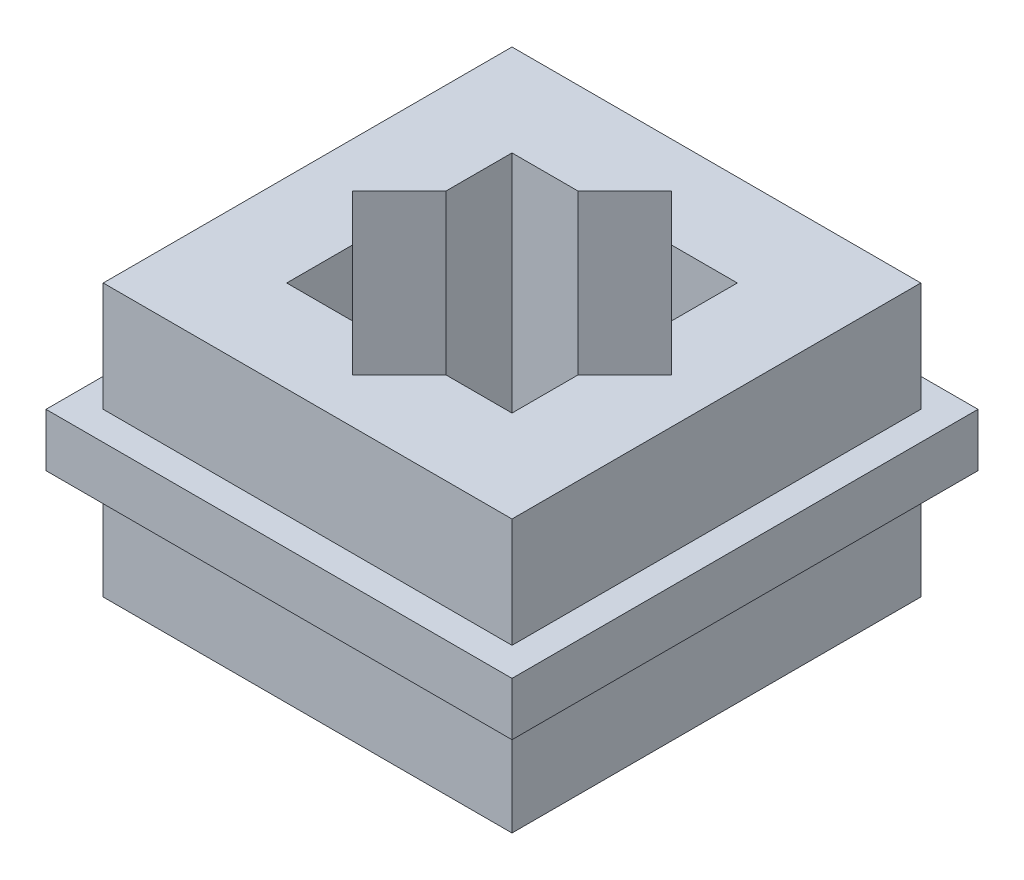
ISO-10303-21;
HEADER;
FILE_DESCRIPTION(('STEP AP214'),'2;1');
FILE_NAME('part.step','',(''),(''),'','','');
FILE_SCHEMA(('AUTOMOTIVE_DESIGN { 1 0 10303 214 1 1 1 1 }'));
ENDSEC;
DATA;
#1=APPLICATION_CONTEXT('core data for automotive mechanical design processes');
#2=APPLICATION_PROTOCOL_DEFINITION('international standard','automotive_design',2000,#1);
#3=PRODUCT_CONTEXT('',#1,'mechanical');
#4=PRODUCT('Part','Part','',(#3));
#5=PRODUCT_RELATED_PRODUCT_CATEGORY('part','',(#4));
#6=PRODUCT_DEFINITION_FORMATION('','',#4);
#7=PRODUCT_DEFINITION_CONTEXT('part definition',#1,'design');
#8=PRODUCT_DEFINITION('design','',#6,#7);
#9=PRODUCT_DEFINITION_SHAPE('','',#8);
#10=(LENGTH_UNIT() NAMED_UNIT(*) SI_UNIT(.MILLI.,.METRE.));
#11=(NAMED_UNIT(*) PLANE_ANGLE_UNIT() SI_UNIT($,.RADIAN.));
#12=(NAMED_UNIT(*) SI_UNIT($,.STERADIAN.) SOLID_ANGLE_UNIT());
#13=UNCERTAINTY_MEASURE_WITH_UNIT(LENGTH_MEASURE(1.E-05),#10,'distance_accuracy_value','');
#14=(GEOMETRIC_REPRESENTATION_CONTEXT(3) GLOBAL_UNCERTAINTY_ASSIGNED_CONTEXT((#13)) GLOBAL_UNIT_ASSIGNED_CONTEXT((#10,
#11,#12)) REPRESENTATION_CONTEXT('',''));
#15=CARTESIAN_POINT('',(0.,0.,0.));
#16=DIRECTION('',(0.,0.,1.));
#17=DIRECTION('',(1.,0.,0.));
#18=AXIS2_PLACEMENT_3D('',#15,#16,#17);
#19=CARTESIAN_POINT('',(0.,8.45,0.));
#20=DIRECTION('',(0.,1.,0.));
#21=DIRECTION('',(0.,0.,1.));
#22=AXIS2_PLACEMENT_3D('',#19,#20,#21);
#23=PLANE('',#22);
#24=DIRECTION('',(-0.707106781186549,0.,0.707106781186547));
#25=VECTOR('',#24,1.);
#26=CARTESIAN_POINT('',(4.94974746830583,8.45,4.94974746830584));
#27=LINE('',#26,#25);
#28=CARTESIAN_POINT('',(2.89949493661166,8.45,7.));
#29=VERTEX_POINT('',#28);
#30=CARTESIAN_POINT('',(0.,8.45,9.89949493661166));
#31=VERTEX_POINT('',#30);
#32=EDGE_CURVE('E72',#29,#31,#27,.T.);
#33=ORIENTED_EDGE('',*,*,#32,.T.);
#34=DIRECTION('',(0.707106781186546,0.,0.707106781186549));
#35=VECTOR('',#34,1.);
#36=CARTESIAN_POINT('',(-4.94974746830584,8.45,4.94974746830583));
#37=LINE('',#36,#35);
#38=CARTESIAN_POINT('',(-2.89949493661167,8.45,7.));
#39=VERTEX_POINT('',#38);
#40=EDGE_CURVE('E297',#39,#31,#37,.T.);
#41=ORIENTED_EDGE('',*,*,#40,.F.);
#42=DIRECTION('',(1.,0.,0.));
#43=VECTOR('',#42,1.);
#44=CARTESIAN_POINT('',(0.,8.45,7.));
#45=LINE('',#44,#43);
#46=CARTESIAN_POINT('',(-7.,8.45,7.));
#47=VERTEX_POINT('',#46);
#48=EDGE_CURVE('E331',#47,#39,#45,.T.);
#49=ORIENTED_EDGE('',*,*,#48,.F.);
#50=DIRECTION('',(0.,0.,1.));
#51=VECTOR('',#50,1.);
#52=CARTESIAN_POINT('',(-7.,8.45,0.));
#53=LINE('',#52,#51);
#54=CARTESIAN_POINT('',(-7.,8.45,2.89949493661166));
#55=VERTEX_POINT('',#54);
#56=EDGE_CURVE('E342',#55,#47,#53,.T.);
#57=ORIENTED_EDGE('',*,*,#56,.F.);
#58=CARTESIAN_POINT('',(-9.89949493661166,8.45,0.));
#59=VERTEX_POINT('',#58);
#60=EDGE_CURVE('E295',#59,#55,#37,.T.);
#61=ORIENTED_EDGE('',*,*,#60,.F.);
#62=DIRECTION('',(-0.707106781186549,0.,0.707106781186546));
#63=VECTOR('',#62,1.);
#64=CARTESIAN_POINT('',(-4.94974746830582,8.45,-4.94974746830584));
#65=LINE('',#64,#63);
#66=CARTESIAN_POINT('',(-7.,8.45,-2.89949493661167));
#67=VERTEX_POINT('',#66);
#68=EDGE_CURVE('E303',#67,#59,#65,.T.);
#69=ORIENTED_EDGE('',*,*,#68,.F.);
#70=CARTESIAN_POINT('',(-7.,8.45,-7.));
#71=VERTEX_POINT('',#70);
#72=EDGE_CURVE('E343',#71,#67,#53,.T.);
#73=ORIENTED_EDGE('',*,*,#72,.F.);
#74=DIRECTION('',(1.,0.,0.));
#75=VECTOR('',#74,1.);
#76=CARTESIAN_POINT('',(0.,8.45,-7.));
#77=LINE('',#76,#75);
#78=CARTESIAN_POINT('',(-2.89949493661166,8.45,-7.));
#79=VERTEX_POINT('',#78);
#80=EDGE_CURVE('E339',#71,#79,#77,.T.);
#81=ORIENTED_EDGE('',*,*,#80,.T.);
#82=CARTESIAN_POINT('',(0.,8.45,-9.89949493661166));
#83=VERTEX_POINT('',#82);
#84=EDGE_CURVE('E304',#83,#79,#65,.T.);
#85=ORIENTED_EDGE('',*,*,#84,.F.);
#86=DIRECTION('',(0.707106781186546,0.,0.707106781186549));
#87=VECTOR('',#86,1.);
#88=CARTESIAN_POINT('',(4.94974746830584,8.45,-4.94974746830582));
#89=LINE('',#88,#87);
#90=CARTESIAN_POINT('',(2.89949493661167,8.45,-7.));
#91=VERTEX_POINT('',#90);
#92=EDGE_CURVE('E300',#83,#91,#89,.T.);
#93=ORIENTED_EDGE('',*,*,#92,.T.);
#94=CARTESIAN_POINT('',(7.,8.45,-7.));
#95=VERTEX_POINT('',#94);
#96=EDGE_CURVE('E338',#91,#95,#77,.T.);
#97=ORIENTED_EDGE('',*,*,#96,.T.);
#98=DIRECTION('',(0.,0.,1.));
#99=VECTOR('',#98,1.);
#100=CARTESIAN_POINT('',(7.,8.45,0.));
#101=LINE('',#100,#99);
#102=CARTESIAN_POINT('',(7.,8.45,-2.89949493661166));
#103=VERTEX_POINT('',#102);
#104=EDGE_CURVE('E335',#95,#103,#101,.T.);
#105=ORIENTED_EDGE('',*,*,#104,.T.);
#106=CARTESIAN_POINT('',(9.89949493661166,8.45,0.));
#107=VERTEX_POINT('',#106);
#108=EDGE_CURVE('E299',#103,#107,#89,.T.);
#109=ORIENTED_EDGE('',*,*,#108,.T.);
#110=CARTESIAN_POINT('',(7.,8.45,2.89949493661167));
#111=VERTEX_POINT('',#110);
#112=EDGE_CURVE('E267',#107,#111,#27,.T.);
#113=ORIENTED_EDGE('',*,*,#112,.T.);
#114=CARTESIAN_POINT('',(7.,8.45,7.));
#115=VERTEX_POINT('',#114);
#116=EDGE_CURVE('E334',#111,#115,#101,.T.);
#117=ORIENTED_EDGE('',*,*,#116,.T.);
#118=EDGE_CURVE('E315',#29,#115,#45,.T.);
#119=ORIENTED_EDGE('',*,*,#118,.F.);
#120=EDGE_LOOP('',(#33,#41,#49,#57,#61,#69,#73,#81,#85,#93,#97,#105,#109,#113,#117,#119));
#121=FACE_BOUND('',#120,.T.);
#122=DIRECTION('',(0.,0.,-1.));
#123=VECTOR('',#122,1.);
#124=CARTESIAN_POINT('',(12.7,8.45,-12.7));
#125=LINE('',#124,#123);
#126=CARTESIAN_POINT('',(12.7,8.45,12.7));
#127=VERTEX_POINT('',#126);
#128=CARTESIAN_POINT('',(12.7,8.45,-12.7));
#129=VERTEX_POINT('',#128);
#130=EDGE_CURVE('E394',#127,#129,#125,.T.);
#131=ORIENTED_EDGE('',*,*,#130,.T.);
#132=DIRECTION('',(-1.,0.,0.));
#133=VECTOR('',#132,1.);
#134=CARTESIAN_POINT('',(-12.7,8.45,-12.7));
#135=LINE('',#134,#133);
#136=CARTESIAN_POINT('',(-12.7,8.45,-12.7));
#137=VERTEX_POINT('',#136);
#138=EDGE_CURVE('E397',#129,#137,#135,.T.);
#139=ORIENTED_EDGE('',*,*,#138,.T.);
#140=DIRECTION('',(0.,0.,1.));
#141=VECTOR('',#140,1.);
#142=CARTESIAN_POINT('',(-12.7,8.45,-12.7));
#143=LINE('',#142,#141);
#144=CARTESIAN_POINT('',(-12.7,8.45,12.7));
#145=VERTEX_POINT('',#144);
#146=EDGE_CURVE('E400',#137,#145,#143,.T.);
#147=ORIENTED_EDGE('',*,*,#146,.T.);
#148=DIRECTION('',(1.,0.,0.));
#149=VECTOR('',#148,1.);
#150=CARTESIAN_POINT('',(-12.7,8.45,12.7));
#151=LINE('',#150,#149);
#152=EDGE_CURVE('E402',#145,#127,#151,.T.);
#153=ORIENTED_EDGE('',*,*,#152,.T.);
#154=EDGE_LOOP('',(#131,#139,#147,#153));
#155=FACE_BOUND('',#154,.T.);
#156=ADVANCED_FACE('F57',(#121,#155),#23,.T.);
#157=CARTESIAN_POINT('',(0.,-8.45,0.));
#158=DIRECTION('',(0.,1.,0.));
#159=DIRECTION('',(0.,0.,1.));
#160=AXIS2_PLACEMENT_3D('',#157,#158,#159);
#161=PLANE('',#160);
#162=DIRECTION('',(0.,0.,-1.));
#163=VECTOR('',#162,1.);
#164=CARTESIAN_POINT('',(12.7,-8.45,-12.7));
#165=LINE('',#164,#163);
#166=CARTESIAN_POINT('',(12.7,-8.45,12.7));
#167=VERTEX_POINT('',#166);
#168=CARTESIAN_POINT('',(12.7,-8.45,-12.7));
#169=VERTEX_POINT('',#168);
#170=EDGE_CURVE('E393',#167,#169,#165,.T.);
#171=ORIENTED_EDGE('',*,*,#170,.F.);
#172=DIRECTION('',(1.,0.,0.));
#173=VECTOR('',#172,1.);
#174=CARTESIAN_POINT('',(-12.7,-8.45,12.7));
#175=LINE('',#174,#173);
#176=CARTESIAN_POINT('',(-12.7,-8.45,12.7));
#177=VERTEX_POINT('',#176);
#178=EDGE_CURVE('E398',#177,#167,#175,.T.);
#179=ORIENTED_EDGE('',*,*,#178,.F.);
#180=DIRECTION('',(0.,0.,1.));
#181=VECTOR('',#180,1.);
#182=CARTESIAN_POINT('',(-12.7,-8.45,-12.7));
#183=LINE('',#182,#181);
#184=CARTESIAN_POINT('',(-12.7,-8.45,-12.7));
#185=VERTEX_POINT('',#184);
#186=EDGE_CURVE('E410',#185,#177,#183,.T.);
#187=ORIENTED_EDGE('',*,*,#186,.F.);
#188=DIRECTION('',(-1.,0.,0.));
#189=VECTOR('',#188,1.);
#190=CARTESIAN_POINT('',(-12.7,-8.45,-12.7));
#191=LINE('',#190,#189);
#192=EDGE_CURVE('E407',#169,#185,#191,.T.);
#193=ORIENTED_EDGE('',*,*,#192,.F.);
#194=EDGE_LOOP('',(#171,#179,#187,#193));
#195=FACE_BOUND('',#194,.T.);
#196=DIRECTION('',(0.707106781186546,0.,0.707106781186549));
#197=VECTOR('',#196,1.);
#198=CARTESIAN_POINT('',(-4.94974746830584,-8.45,4.94974746830583));
#199=LINE('',#198,#197);
#200=CARTESIAN_POINT('',(-2.89949493661167,-8.45,7.));
#201=VERTEX_POINT('',#200);
#202=CARTESIAN_POINT('',(0.,-8.45,9.89949493661166));
#203=VERTEX_POINT('',#202);
#204=EDGE_CURVE('E289',#201,#203,#199,.T.);
#205=ORIENTED_EDGE('',*,*,#204,.T.);
#206=DIRECTION('',(-0.707106781186549,0.,0.707106781186547));
#207=VECTOR('',#206,1.);
#208=CARTESIAN_POINT('',(4.94974746830583,-8.45,4.94974746830584));
#209=LINE('',#208,#207);
#210=CARTESIAN_POINT('',(2.89949493661166,-8.45,7.));
#211=VERTEX_POINT('',#210);
#212=EDGE_CURVE('E262',#211,#203,#209,.T.);
#213=ORIENTED_EDGE('',*,*,#212,.F.);
#214=DIRECTION('',(1.,0.,0.));
#215=VECTOR('',#214,1.);
#216=CARTESIAN_POINT('',(0.,-8.45,7.));
#217=LINE('',#216,#215);
#218=CARTESIAN_POINT('',(7.,-8.45,7.));
#219=VERTEX_POINT('',#218);
#220=EDGE_CURVE('E319',#211,#219,#217,.T.);
#221=ORIENTED_EDGE('',*,*,#220,.T.);
#222=DIRECTION('',(0.,0.,1.));
#223=VECTOR('',#222,1.);
#224=CARTESIAN_POINT('',(7.,-8.45,0.));
#225=LINE('',#224,#223);
#226=CARTESIAN_POINT('',(7.,-8.45,2.89949493661167));
#227=VERTEX_POINT('',#226);
#228=EDGE_CURVE('E259',#227,#219,#225,.T.);
#229=ORIENTED_EDGE('',*,*,#228,.F.);
#230=CARTESIAN_POINT('',(9.89949493661166,-8.45,0.));
#231=VERTEX_POINT('',#230);
#232=EDGE_CURVE('E253',#231,#227,#209,.T.);
#233=ORIENTED_EDGE('',*,*,#232,.F.);
#234=DIRECTION('',(0.707106781186546,0.,0.707106781186549));
#235=VECTOR('',#234,1.);
#236=CARTESIAN_POINT('',(4.94974746830584,-8.45,-4.94974746830582));
#237=LINE('',#236,#235);
#238=CARTESIAN_POINT('',(7.,-8.45,-2.89949493661166));
#239=VERTEX_POINT('',#238);
#240=EDGE_CURVE('E242',#239,#231,#237,.T.);
#241=ORIENTED_EDGE('',*,*,#240,.F.);
#242=CARTESIAN_POINT('',(7.,-8.45,-7.));
#243=VERTEX_POINT('',#242);
#244=EDGE_CURVE('E320',#243,#239,#225,.T.);
#245=ORIENTED_EDGE('',*,*,#244,.F.);
#246=DIRECTION('',(1.,0.,0.));
#247=VECTOR('',#246,1.);
#248=CARTESIAN_POINT('',(0.,-8.45,-7.));
#249=LINE('',#248,#247);
#250=CARTESIAN_POINT('',(2.89949493661167,-8.45,-7.));
#251=VERTEX_POINT('',#250);
#252=EDGE_CURVE('E322',#251,#243,#249,.T.);
#253=ORIENTED_EDGE('',*,*,#252,.F.);
#254=CARTESIAN_POINT('',(0.,-8.45,-9.89949493661166));
#255=VERTEX_POINT('',#254);
#256=EDGE_CURVE('E252',#255,#251,#237,.T.);
#257=ORIENTED_EDGE('',*,*,#256,.F.);
#258=DIRECTION('',(-0.707106781186549,0.,0.707106781186546));
#259=VECTOR('',#258,1.);
#260=CARTESIAN_POINT('',(-4.94974746830582,-8.45,-4.94974746830584));
#261=LINE('',#260,#259);
#262=CARTESIAN_POINT('',(-2.89949493661166,-8.45,-7.));
#263=VERTEX_POINT('',#262);
#264=EDGE_CURVE('E291',#255,#263,#261,.T.);
#265=ORIENTED_EDGE('',*,*,#264,.T.);
#266=CARTESIAN_POINT('',(-7.,-8.45,-7.));
#267=VERTEX_POINT('',#266);
#268=EDGE_CURVE('E323',#267,#263,#249,.T.);
#269=ORIENTED_EDGE('',*,*,#268,.F.);
#270=DIRECTION('',(0.,0.,1.));
#271=VECTOR('',#270,1.);
#272=CARTESIAN_POINT('',(-7.,-8.45,0.));
#273=LINE('',#272,#271);
#274=CARTESIAN_POINT('',(-7.,-8.45,-2.89949493661167));
#275=VERTEX_POINT('',#274);
#276=EDGE_CURVE('E327',#267,#275,#273,.T.);
#277=ORIENTED_EDGE('',*,*,#276,.T.);
#278=CARTESIAN_POINT('',(-9.89949493661166,-8.45,0.));
#279=VERTEX_POINT('',#278);
#280=EDGE_CURVE('E80',#275,#279,#261,.T.);
#281=ORIENTED_EDGE('',*,*,#280,.T.);
#282=CARTESIAN_POINT('',(-7.,-8.45,2.89949493661166));
#283=VERTEX_POINT('',#282);
#284=EDGE_CURVE('E287',#279,#283,#199,.T.);
#285=ORIENTED_EDGE('',*,*,#284,.T.);
#286=CARTESIAN_POINT('',(-7.,-8.45,7.));
#287=VERTEX_POINT('',#286);
#288=EDGE_CURVE('E326',#283,#287,#273,.T.);
#289=ORIENTED_EDGE('',*,*,#288,.T.);
#290=EDGE_CURVE('E316',#287,#201,#217,.T.);
#291=ORIENTED_EDGE('',*,*,#290,.T.);
#292=EDGE_LOOP('',(#205,#213,#221,#229,#233,#241,#245,#253,#257,#265,#269,#277,#281,#285,#289,#291));
#293=FACE_BOUND('',#292,.T.);
#294=ADVANCED_FACE('F257',(#195,#293),#161,.F.);
#295=CARTESIAN_POINT('',(0.,-8.45,7.));
#296=DIRECTION('',(0.,0.,1.));
#297=DIRECTION('',(1.,0.,0.));
#298=AXIS2_PLACEMENT_3D('',#295,#296,#297);
#299=PLANE('',#298);
#300=DIRECTION('',(0.,-1.,0.));
#301=VECTOR('',#300,1.);
#302=CARTESIAN_POINT('',(2.89949493661166,-8.45,7.));
#303=LINE('',#302,#301);
#304=EDGE_CURVE('E294',#29,#211,#303,.T.);
#305=ORIENTED_EDGE('',*,*,#304,.F.);
#306=ORIENTED_EDGE('',*,*,#118,.T.);
#307=DIRECTION('',(0.,1.,0.));
#308=VECTOR('',#307,1.);
#309=CARTESIAN_POINT('',(7.,-8.45,7.));
#310=LINE('',#309,#308);
#311=EDGE_CURVE('E282',#219,#115,#310,.T.);
#312=ORIENTED_EDGE('',*,*,#311,.F.);
#313=ORIENTED_EDGE('',*,*,#220,.F.);
#314=EDGE_LOOP('',(#305,#306,#312,#313));
#315=FACE_BOUND('',#314,.T.);
#316=ADVANCED_FACE('F494',(#315),#299,.F.);
#317=CARTESIAN_POINT('',(-7.,-8.45,0.));
#318=DIRECTION('',(-1.,0.,0.));
#319=DIRECTION('',(0.,0.,1.));
#320=AXIS2_PLACEMENT_3D('',#317,#318,#319);
#321=PLANE('',#320);
#322=ORIENTED_EDGE('',*,*,#288,.F.);
#323=DIRECTION('',(0.,1.,0.));
#324=VECTOR('',#323,1.);
#325=CARTESIAN_POINT('',(-7.,-8.45,2.89949493661166));
#326=LINE('',#325,#324);
#327=EDGE_CURVE('E12',#283,#55,#326,.T.);
#328=ORIENTED_EDGE('',*,*,#327,.T.);
#329=ORIENTED_EDGE('',*,*,#56,.T.);
#330=DIRECTION('',(0.,1.,0.));
#331=VECTOR('',#330,1.);
#332=CARTESIAN_POINT('',(-7.,-8.45,7.));
#333=LINE('',#332,#331);
#334=EDGE_CURVE('E279',#287,#47,#333,.T.);
#335=ORIENTED_EDGE('',*,*,#334,.F.);
#336=EDGE_LOOP('',(#322,#328,#329,#335));
#337=FACE_BOUND('',#336,.T.);
#338=ADVANCED_FACE('F477',(#337),#321,.F.);
#339=CARTESIAN_POINT('',(0.,-8.45,-7.));
#340=DIRECTION('',(0.,0.,1.));
#341=DIRECTION('',(1.,0.,0.));
#342=AXIS2_PLACEMENT_3D('',#339,#340,#341);
#343=PLANE('',#342);
#344=ORIENTED_EDGE('',*,*,#96,.F.);
#345=DIRECTION('',(0.,-1.,0.));
#346=VECTOR('',#345,1.);
#347=CARTESIAN_POINT('',(2.89949493661167,-8.45,-7.));
#348=LINE('',#347,#346);
#349=EDGE_CURVE('E307',#91,#251,#348,.T.);
#350=ORIENTED_EDGE('',*,*,#349,.T.);
#351=ORIENTED_EDGE('',*,*,#252,.T.);
#352=DIRECTION('',(0.,1.,0.));
#353=VECTOR('',#352,1.);
#354=CARTESIAN_POINT('',(7.,-8.45,-7.));
#355=LINE('',#354,#353);
#356=EDGE_CURVE('E275',#243,#95,#355,.T.);
#357=ORIENTED_EDGE('',*,*,#356,.T.);
#358=EDGE_LOOP('',(#344,#350,#351,#357));
#359=FACE_BOUND('',#358,.T.);
#360=ADVANCED_FACE('F482',(#359),#343,.T.);
#361=CARTESIAN_POINT('',(7.,-8.45,0.));
#362=DIRECTION('',(-1.,0.,0.));
#363=DIRECTION('',(0.,0.,1.));
#364=AXIS2_PLACEMENT_3D('',#361,#362,#363);
#365=PLANE('',#364);
#366=ORIENTED_EDGE('',*,*,#244,.T.);
#367=DIRECTION('',(0.,1.,0.));
#368=VECTOR('',#367,1.);
#369=CARTESIAN_POINT('',(7.,-8.45,-2.89949493661166));
#370=LINE('',#369,#368);
#371=EDGE_CURVE('E248',#239,#103,#370,.T.);
#372=ORIENTED_EDGE('',*,*,#371,.T.);
#373=ORIENTED_EDGE('',*,*,#104,.F.);
#374=ORIENTED_EDGE('',*,*,#356,.F.);
#375=EDGE_LOOP('',(#366,#372,#373,#374));
#376=FACE_BOUND('',#375,.T.);
#377=ADVANCED_FACE('F486',(#376),#365,.T.);
#378=ORIENTED_EDGE('',*,*,#116,.F.);
#379=DIRECTION('',(0.,-1.,0.));
#380=VECTOR('',#379,1.);
#381=CARTESIAN_POINT('',(7.,-8.45,2.89949493661167));
#382=LINE('',#381,#380);
#383=EDGE_CURVE('E436',#111,#227,#382,.T.);
#384=ORIENTED_EDGE('',*,*,#383,.T.);
#385=ORIENTED_EDGE('',*,*,#228,.T.);
#386=ORIENTED_EDGE('',*,*,#311,.T.);
#387=EDGE_LOOP('',(#378,#384,#385,#386));
#388=FACE_BOUND('',#387,.T.);
#389=ADVANCED_FACE('F490',(#388),#365,.T.);
#390=CARTESIAN_POINT('',(12.7,8.45,-12.7));
#391=DIRECTION('',(-1.,0.,0.));
#392=DIRECTION('',(0.,0.,1.));
#393=AXIS2_PLACEMENT_3D('',#390,#391,#392);
#394=PLANE('',#393);
#395=DIRECTION('',(0.,-1.,0.));
#396=VECTOR('',#395,1.);
#397=CARTESIAN_POINT('',(12.7,8.45,12.7));
#398=LINE('',#397,#396);
#399=CARTESIAN_POINT('',(12.7,1.651,12.7));
#400=VERTEX_POINT('',#399);
#401=EDGE_CURVE('E415',#127,#400,#398,.T.);
#402=ORIENTED_EDGE('',*,*,#401,.T.);
#403=DIRECTION('',(0.,0.,-1.));
#404=VECTOR('',#403,1.);
#405=CARTESIAN_POINT('',(12.7,1.651,-12.7));
#406=LINE('',#405,#404);
#407=CARTESIAN_POINT('',(12.7,1.651,-12.7));
#408=VERTEX_POINT('',#407);
#409=EDGE_CURVE('E390',#400,#408,#406,.T.);
#410=ORIENTED_EDGE('',*,*,#409,.T.);
#411=DIRECTION('',(0.,-1.,0.));
#412=VECTOR('',#411,1.);
#413=CARTESIAN_POINT('',(12.7,8.45,-12.7));
#414=LINE('',#413,#412);
#415=EDGE_CURVE('E427',#129,#408,#414,.T.);
#416=ORIENTED_EDGE('',*,*,#415,.F.);
#417=ORIENTED_EDGE('',*,*,#130,.F.);
#418=EDGE_LOOP('',(#402,#410,#416,#417));
#419=FACE_BOUND('',#418,.T.);
#420=ADVANCED_FACE('F59',(#419),#394,.F.);
#421=CARTESIAN_POINT('',(-12.7,8.45,-12.7));
#422=DIRECTION('',(0.,0.,1.));
#423=DIRECTION('',(1.,0.,0.));
#424=AXIS2_PLACEMENT_3D('',#421,#422,#423);
#425=PLANE('',#424);
#426=ORIENTED_EDGE('',*,*,#415,.T.);
#427=DIRECTION('',(-1.,0.,0.));
#428=VECTOR('',#427,1.);
#429=CARTESIAN_POINT('',(-12.7,1.651,-12.7));
#430=LINE('',#429,#428);
#431=CARTESIAN_POINT('',(-12.7,1.651,-12.7));
#432=VERTEX_POINT('',#431);
#433=EDGE_CURVE('E387',#408,#432,#430,.T.);
#434=ORIENTED_EDGE('',*,*,#433,.T.);
#435=DIRECTION('',(0.,-1.,0.));
#436=VECTOR('',#435,1.);
#437=CARTESIAN_POINT('',(-12.7,8.45,-12.7));
#438=LINE('',#437,#436);
#439=EDGE_CURVE('E423',#137,#432,#438,.T.);
#440=ORIENTED_EDGE('',*,*,#439,.F.);
#441=ORIENTED_EDGE('',*,*,#138,.F.);
#442=EDGE_LOOP('',(#426,#434,#440,#441));
#443=FACE_BOUND('',#442,.T.);
#444=ADVANCED_FACE('F524',(#443),#425,.F.);
#445=CARTESIAN_POINT('',(-12.7,8.45,-12.7));
#446=DIRECTION('',(1.,0.,0.));
#447=DIRECTION('',(0.,0.,-1.));
#448=AXIS2_PLACEMENT_3D('',#445,#446,#447);
#449=PLANE('',#448);
#450=ORIENTED_EDGE('',*,*,#439,.T.);
#451=DIRECTION('',(0.,0.,1.));
#452=VECTOR('',#451,1.);
#453=CARTESIAN_POINT('',(-12.7,1.651,-12.7));
#454=LINE('',#453,#452);
#455=CARTESIAN_POINT('',(-12.7,1.651,12.7));
#456=VERTEX_POINT('',#455);
#457=EDGE_CURVE('E384',#432,#456,#454,.T.);
#458=ORIENTED_EDGE('',*,*,#457,.T.);
#459=DIRECTION('',(0.,-1.,0.));
#460=VECTOR('',#459,1.);
#461=CARTESIAN_POINT('',(-12.7,8.45,12.7));
#462=LINE('',#461,#460);
#463=EDGE_CURVE('E419',#145,#456,#462,.T.);
#464=ORIENTED_EDGE('',*,*,#463,.F.);
#465=ORIENTED_EDGE('',*,*,#146,.F.);
#466=EDGE_LOOP('',(#450,#458,#464,#465));
#467=FACE_BOUND('',#466,.T.);
#468=ADVANCED_FACE('F520',(#467),#449,.F.);
#469=CARTESIAN_POINT('',(-12.7,8.45,12.7));
#470=DIRECTION('',(0.,0.,-1.));
#471=DIRECTION('',(-1.,0.,0.));
#472=AXIS2_PLACEMENT_3D('',#469,#470,#471);
#473=PLANE('',#472);
#474=ORIENTED_EDGE('',*,*,#463,.T.);
#475=DIRECTION('',(1.,0.,0.));
#476=VECTOR('',#475,1.);
#477=CARTESIAN_POINT('',(-12.7,1.651,12.7));
#478=LINE('',#477,#476);
#479=EDGE_CURVE('E433',#456,#400,#478,.T.);
#480=ORIENTED_EDGE('',*,*,#479,.T.);
#481=ORIENTED_EDGE('',*,*,#401,.F.);
#482=ORIENTED_EDGE('',*,*,#152,.F.);
#483=EDGE_LOOP('',(#474,#480,#481,#482));
#484=FACE_BOUND('',#483,.T.);
#485=ADVANCED_FACE('F516',(#484),#473,.F.);
#486=CARTESIAN_POINT('',(0.,1.651,0.));
#487=DIRECTION('',(0.,1.,0.));
#488=DIRECTION('',(0.,0.,1.));
#489=AXIS2_PLACEMENT_3D('',#486,#487,#488);
#490=PLANE('',#489);
#491=DIRECTION('',(0.,0.,1.));
#492=VECTOR('',#491,1.);
#493=CARTESIAN_POINT('',(-14.478,1.651,14.478));
#494=LINE('',#493,#492);
#495=CARTESIAN_POINT('',(-14.478,1.651,-14.478));
#496=VERTEX_POINT('',#495);
#497=CARTESIAN_POINT('',(-14.478,1.651,14.478));
#498=VERTEX_POINT('',#497);
#499=EDGE_CURVE('E346',#496,#498,#494,.T.);
#500=ORIENTED_EDGE('',*,*,#499,.T.);
#501=DIRECTION('',(1.,0.,0.));
#502=VECTOR('',#501,1.);
#503=CARTESIAN_POINT('',(14.478,1.651,14.478));
#504=LINE('',#503,#502);
#505=CARTESIAN_POINT('',(14.478,1.651,14.478));
#506=VERTEX_POINT('',#505);
#507=EDGE_CURVE('E349',#498,#506,#504,.T.);
#508=ORIENTED_EDGE('',*,*,#507,.T.);
#509=DIRECTION('',(0.,0.,-1.));
#510=VECTOR('',#509,1.);
#511=CARTESIAN_POINT('',(14.478,1.651,14.478));
#512=LINE('',#511,#510);
#513=CARTESIAN_POINT('',(14.478,1.651,-14.478));
#514=VERTEX_POINT('',#513);
#515=EDGE_CURVE('E352',#506,#514,#512,.T.);
#516=ORIENTED_EDGE('',*,*,#515,.T.);
#517=DIRECTION('',(-1.,0.,0.));
#518=VECTOR('',#517,1.);
#519=CARTESIAN_POINT('',(14.478,1.651,-14.478));
#520=LINE('',#519,#518);
#521=EDGE_CURVE('E354',#514,#496,#520,.T.);
#522=ORIENTED_EDGE('',*,*,#521,.T.);
#523=EDGE_LOOP('',(#500,#508,#516,#522));
#524=FACE_BOUND('',#523,.T.);
#525=ORIENTED_EDGE('',*,*,#409,.F.);
#526=ORIENTED_EDGE('',*,*,#479,.F.);
#527=ORIENTED_EDGE('',*,*,#457,.F.);
#528=ORIENTED_EDGE('',*,*,#433,.F.);
#529=EDGE_LOOP('',(#525,#526,#527,#528));
#530=FACE_BOUND('',#529,.T.);
#531=ADVANCED_FACE('F519',(#524,#530),#490,.T.);
#532=CARTESIAN_POINT('',(0.,-1.651,0.));
#533=DIRECTION('',(0.,1.,0.));
#534=DIRECTION('',(0.,0.,1.));
#535=AXIS2_PLACEMENT_3D('',#532,#533,#534);
#536=PLANE('',#535);
#537=DIRECTION('',(0.,0.,1.));
#538=VECTOR('',#537,1.);
#539=CARTESIAN_POINT('',(-14.478,-1.651,14.478));
#540=LINE('',#539,#538);
#541=CARTESIAN_POINT('',(-14.478,-1.651,-14.478));
#542=VERTEX_POINT('',#541);
#543=CARTESIAN_POINT('',(-14.478,-1.651,14.478));
#544=VERTEX_POINT('',#543);
#545=EDGE_CURVE('E330',#542,#544,#540,.T.);
#546=ORIENTED_EDGE('',*,*,#545,.F.);
#547=DIRECTION('',(-1.,0.,0.));
#548=VECTOR('',#547,1.);
#549=CARTESIAN_POINT('',(14.478,-1.651,-14.478));
#550=LINE('',#549,#548);
#551=CARTESIAN_POINT('',(14.478,-1.651,-14.478));
#552=VERTEX_POINT('',#551);
#553=EDGE_CURVE('E350',#552,#542,#550,.T.);
#554=ORIENTED_EDGE('',*,*,#553,.F.);
#555=DIRECTION('',(0.,0.,-1.));
#556=VECTOR('',#555,1.);
#557=CARTESIAN_POINT('',(14.478,-1.651,14.478));
#558=LINE('',#557,#556);
#559=CARTESIAN_POINT('',(14.478,-1.651,14.478));
#560=VERTEX_POINT('',#559);
#561=EDGE_CURVE('E361',#560,#552,#558,.T.);
#562=ORIENTED_EDGE('',*,*,#561,.F.);
#563=DIRECTION('',(1.,0.,0.));
#564=VECTOR('',#563,1.);
#565=CARTESIAN_POINT('',(14.478,-1.651,14.478));
#566=LINE('',#565,#564);
#567=EDGE_CURVE('E359',#544,#560,#566,.T.);
#568=ORIENTED_EDGE('',*,*,#567,.F.);
#569=EDGE_LOOP('',(#546,#554,#562,#568));
#570=FACE_BOUND('',#569,.T.);
#571=DIRECTION('',(1.,0.,0.));
#572=VECTOR('',#571,1.);
#573=CARTESIAN_POINT('',(-12.7,-1.651,12.7));
#574=LINE('',#573,#572);
#575=CARTESIAN_POINT('',(-12.7,-1.651,12.7));
#576=VERTEX_POINT('',#575);
#577=CARTESIAN_POINT('',(12.7,-1.651,12.7));
#578=VERTEX_POINT('',#577);
#579=EDGE_CURVE('E430',#576,#578,#574,.T.);
#580=ORIENTED_EDGE('',*,*,#579,.T.);
#581=DIRECTION('',(0.,0.,-1.));
#582=VECTOR('',#581,1.);
#583=CARTESIAN_POINT('',(12.7,-1.651,-12.7));
#584=LINE('',#583,#582);
#585=CARTESIAN_POINT('',(12.7,-1.651,-12.7));
#586=VERTEX_POINT('',#585);
#587=EDGE_CURVE('E381',#578,#586,#584,.T.);
#588=ORIENTED_EDGE('',*,*,#587,.T.);
#589=DIRECTION('',(-1.,0.,0.));
#590=VECTOR('',#589,1.);
#591=CARTESIAN_POINT('',(-12.7,-1.651,-12.7));
#592=LINE('',#591,#590);
#593=CARTESIAN_POINT('',(-12.7,-1.651,-12.7));
#594=VERTEX_POINT('',#593);
#595=EDGE_CURVE('E378',#586,#594,#592,.T.);
#596=ORIENTED_EDGE('',*,*,#595,.T.);
#597=DIRECTION('',(0.,0.,1.));
#598=VECTOR('',#597,1.);
#599=CARTESIAN_POINT('',(-12.7,-1.651,-12.7));
#600=LINE('',#599,#598);
#601=EDGE_CURVE('E375',#594,#576,#600,.T.);
#602=ORIENTED_EDGE('',*,*,#601,.T.);
#603=EDGE_LOOP('',(#580,#588,#596,#602));
#604=FACE_BOUND('',#603,.T.);
#605=ADVANCED_FACE('F549',(#570,#604),#536,.F.);
#606=CARTESIAN_POINT('',(-14.478,1.651,14.478));
#607=DIRECTION('',(1.,0.,0.));
#608=DIRECTION('',(0.,0.,-1.));
#609=AXIS2_PLACEMENT_3D('',#606,#607,#608);
#610=PLANE('',#609);
#611=ORIENTED_EDGE('',*,*,#545,.T.);
#612=DIRECTION('',(0.,-1.,0.));
#613=VECTOR('',#612,1.);
#614=CARTESIAN_POINT('',(-14.478,1.651,14.478));
#615=LINE('',#614,#613);
#616=EDGE_CURVE('E372',#498,#544,#615,.T.);
#617=ORIENTED_EDGE('',*,*,#616,.F.);
#618=ORIENTED_EDGE('',*,*,#499,.F.);
#619=DIRECTION('',(0.,-1.,0.));
#620=VECTOR('',#619,1.);
#621=CARTESIAN_POINT('',(-14.478,1.651,-14.478));
#622=LINE('',#621,#620);
#623=EDGE_CURVE('E356',#496,#542,#622,.T.);
#624=ORIENTED_EDGE('',*,*,#623,.T.);
#625=EDGE_LOOP('',(#611,#617,#618,#624));
#626=FACE_BOUND('',#625,.T.);
#627=ADVANCED_FACE('F513',(#626),#610,.F.);
#628=CARTESIAN_POINT('',(14.478,1.651,14.478));
#629=DIRECTION('',(0.,0.,-1.));
#630=DIRECTION('',(-1.,0.,0.));
#631=AXIS2_PLACEMENT_3D('',#628,#629,#630);
#632=PLANE('',#631);
#633=ORIENTED_EDGE('',*,*,#567,.T.);
#634=DIRECTION('',(0.,-1.,0.));
#635=VECTOR('',#634,1.);
#636=CARTESIAN_POINT('',(14.478,1.651,14.478));
#637=LINE('',#636,#635);
#638=EDGE_CURVE('E369',#506,#560,#637,.T.);
#639=ORIENTED_EDGE('',*,*,#638,.F.);
#640=ORIENTED_EDGE('',*,*,#507,.F.);
#641=ORIENTED_EDGE('',*,*,#616,.T.);
#642=EDGE_LOOP('',(#633,#639,#640,#641));
#643=FACE_BOUND('',#642,.T.);
#644=ADVANCED_FACE('F565',(#643),#632,.F.);
#645=CARTESIAN_POINT('',(14.478,1.651,14.478));
#646=DIRECTION('',(-1.,0.,0.));
#647=DIRECTION('',(0.,0.,1.));
#648=AXIS2_PLACEMENT_3D('',#645,#646,#647);
#649=PLANE('',#648);
#650=ORIENTED_EDGE('',*,*,#561,.T.);
#651=DIRECTION('',(0.,-1.,0.));
#652=VECTOR('',#651,1.);
#653=CARTESIAN_POINT('',(14.478,1.651,-14.478));
#654=LINE('',#653,#652);
#655=EDGE_CURVE('E366',#514,#552,#654,.T.);
#656=ORIENTED_EDGE('',*,*,#655,.F.);
#657=ORIENTED_EDGE('',*,*,#515,.F.);
#658=ORIENTED_EDGE('',*,*,#638,.T.);
#659=EDGE_LOOP('',(#650,#656,#657,#658));
#660=FACE_BOUND('',#659,.T.);
#661=ADVANCED_FACE('F559',(#660),#649,.F.);
#662=CARTESIAN_POINT('',(14.478,1.651,-14.478));
#663=DIRECTION('',(0.,0.,1.));
#664=DIRECTION('',(1.,0.,0.));
#665=AXIS2_PLACEMENT_3D('',#662,#663,#664);
#666=PLANE('',#665);
#667=ORIENTED_EDGE('',*,*,#553,.T.);
#668=ORIENTED_EDGE('',*,*,#623,.F.);
#669=ORIENTED_EDGE('',*,*,#521,.F.);
#670=ORIENTED_EDGE('',*,*,#655,.T.);
#671=EDGE_LOOP('',(#667,#668,#669,#670));
#672=FACE_BOUND('',#671,.T.);
#673=ADVANCED_FACE('F555',(#672),#666,.F.);
#674=ORIENTED_EDGE('',*,*,#579,.F.);
#675=EDGE_CURVE('E418',#576,#177,#462,.T.);
#676=ORIENTED_EDGE('',*,*,#675,.T.);
#677=ORIENTED_EDGE('',*,*,#178,.T.);
#678=EDGE_CURVE('E404',#578,#167,#398,.T.);
#679=ORIENTED_EDGE('',*,*,#678,.F.);
#680=EDGE_LOOP('',(#674,#676,#677,#679));
#681=FACE_BOUND('',#680,.T.);
#682=ADVANCED_FACE('F522',(#681),#473,.F.);
#683=ORIENTED_EDGE('',*,*,#601,.F.);
#684=EDGE_CURVE('E422',#594,#185,#438,.T.);
#685=ORIENTED_EDGE('',*,*,#684,.T.);
#686=ORIENTED_EDGE('',*,*,#186,.T.);
#687=ORIENTED_EDGE('',*,*,#675,.F.);
#688=EDGE_LOOP('',(#683,#685,#686,#687));
#689=FACE_BOUND('',#688,.T.);
#690=ADVANCED_FACE('F526',(#689),#449,.F.);
#691=ORIENTED_EDGE('',*,*,#595,.F.);
#692=EDGE_CURVE('E426',#586,#169,#414,.T.);
#693=ORIENTED_EDGE('',*,*,#692,.T.);
#694=ORIENTED_EDGE('',*,*,#192,.T.);
#695=ORIENTED_EDGE('',*,*,#684,.F.);
#696=EDGE_LOOP('',(#691,#693,#694,#695));
#697=FACE_BOUND('',#696,.T.);
#698=ADVANCED_FACE('F529',(#697),#425,.F.);
#699=ORIENTED_EDGE('',*,*,#587,.F.);
#700=ORIENTED_EDGE('',*,*,#678,.T.);
#701=ORIENTED_EDGE('',*,*,#170,.T.);
#702=ORIENTED_EDGE('',*,*,#692,.F.);
#703=EDGE_LOOP('',(#699,#700,#701,#702));
#704=FACE_BOUND('',#703,.T.);
#705=ADVANCED_FACE('F534',(#704),#394,.F.);
#706=ORIENTED_EDGE('',*,*,#48,.T.);
#707=DIRECTION('',(0.,-1.,0.));
#708=VECTOR('',#707,1.);
#709=CARTESIAN_POINT('',(-2.89949493661167,-8.45,7.));
#710=LINE('',#709,#708);
#711=EDGE_CURVE('E312',#39,#201,#710,.T.);
#712=ORIENTED_EDGE('',*,*,#711,.T.);
#713=ORIENTED_EDGE('',*,*,#290,.F.);
#714=ORIENTED_EDGE('',*,*,#334,.T.);
#715=EDGE_LOOP('',(#706,#712,#713,#714));
#716=FACE_BOUND('',#715,.T.);
#717=ADVANCED_FACE('F473',(#716),#299,.F.);
#718=ORIENTED_EDGE('',*,*,#72,.T.);
#719=DIRECTION('',(0.,-1.,0.));
#720=VECTOR('',#719,1.);
#721=CARTESIAN_POINT('',(-7.,-8.45,-2.89949493661167));
#722=LINE('',#721,#720);
#723=EDGE_CURVE('E310',#67,#275,#722,.T.);
#724=ORIENTED_EDGE('',*,*,#723,.T.);
#725=ORIENTED_EDGE('',*,*,#276,.F.);
#726=DIRECTION('',(0.,1.,0.));
#727=VECTOR('',#726,1.);
#728=CARTESIAN_POINT('',(-7.,-8.45,-7.));
#729=LINE('',#728,#727);
#730=EDGE_CURVE('E269',#267,#71,#729,.T.);
#731=ORIENTED_EDGE('',*,*,#730,.T.);
#732=EDGE_LOOP('',(#718,#724,#725,#731));
#733=FACE_BOUND('',#732,.T.);
#734=ADVANCED_FACE('F451',(#733),#321,.F.);
#735=DIRECTION('',(0.,-1.,0.));
#736=VECTOR('',#735,1.);
#737=CARTESIAN_POINT('',(-2.89949493661166,-8.45,-7.));
#738=LINE('',#737,#736);
#739=EDGE_CURVE('E65',#79,#263,#738,.T.);
#740=ORIENTED_EDGE('',*,*,#739,.F.);
#741=ORIENTED_EDGE('',*,*,#80,.F.);
#742=ORIENTED_EDGE('',*,*,#730,.F.);
#743=ORIENTED_EDGE('',*,*,#268,.T.);
#744=EDGE_LOOP('',(#740,#741,#742,#743));
#745=FACE_BOUND('',#744,.T.);
#746=ADVANCED_FACE('F449',(#745),#343,.T.);
#747=CARTESIAN_POINT('',(4.94974746830584,-8.45,-4.94974746830582));
#748=DIRECTION('',(-0.707106781186549,0.,0.707106781186546));
#749=DIRECTION('',(0.707106781186546,0.,0.707106781186549));
#750=AXIS2_PLACEMENT_3D('',#747,#748,#749);
#751=PLANE('',#750);
#752=ORIENTED_EDGE('',*,*,#240,.T.);
#753=DIRECTION('',(0.,1.,0.));
#754=VECTOR('',#753,1.);
#755=CARTESIAN_POINT('',(9.89949493661166,-8.45,0.));
#756=LINE('',#755,#754);
#757=EDGE_CURVE('E246',#231,#107,#756,.T.);
#758=ORIENTED_EDGE('',*,*,#757,.T.);
#759=ORIENTED_EDGE('',*,*,#108,.F.);
#760=ORIENTED_EDGE('',*,*,#371,.F.);
#761=EDGE_LOOP('',(#752,#758,#759,#760));
#762=FACE_BOUND('',#761,.T.);
#763=ADVANCED_FACE('F244',(#762),#751,.T.);
#764=CARTESIAN_POINT('',(4.94974746830583,-8.45,4.94974746830584));
#765=DIRECTION('',(-0.707106781186547,0.,-0.707106781186549));
#766=DIRECTION('',(-0.707106781186549,0.,0.707106781186547));
#767=AXIS2_PLACEMENT_3D('',#764,#765,#766);
#768=PLANE('',#767);
#769=ORIENTED_EDGE('',*,*,#112,.F.);
#770=ORIENTED_EDGE('',*,*,#757,.F.);
#771=ORIENTED_EDGE('',*,*,#232,.T.);
#772=ORIENTED_EDGE('',*,*,#383,.F.);
#773=EDGE_LOOP('',(#769,#770,#771,#772));
#774=FACE_BOUND('',#773,.T.);
#775=ADVANCED_FACE('F265',(#774),#768,.T.);
#776=CARTESIAN_POINT('',(-4.94974746830582,-8.45,-4.94974746830584));
#777=DIRECTION('',(-0.707106781186547,0.,-0.707106781186549));
#778=DIRECTION('',(-0.707106781186549,0.,0.707106781186546));
#779=AXIS2_PLACEMENT_3D('',#776,#777,#778);
#780=PLANE('',#779);
#781=ORIENTED_EDGE('',*,*,#739,.T.);
#782=ORIENTED_EDGE('',*,*,#264,.F.);
#783=DIRECTION('',(0.,1.,0.));
#784=VECTOR('',#783,1.);
#785=CARTESIAN_POINT('',(0.,-8.45,-9.89949493661166));
#786=LINE('',#785,#784);
#787=EDGE_CURVE('E268',#255,#83,#786,.T.);
#788=ORIENTED_EDGE('',*,*,#787,.T.);
#789=ORIENTED_EDGE('',*,*,#84,.T.);
#790=EDGE_LOOP('',(#781,#782,#788,#789));
#791=FACE_BOUND('',#790,.T.);
#792=ADVANCED_FACE('F441',(#791),#780,.F.);
#793=ORIENTED_EDGE('',*,*,#92,.F.);
#794=ORIENTED_EDGE('',*,*,#787,.F.);
#795=ORIENTED_EDGE('',*,*,#256,.T.);
#796=ORIENTED_EDGE('',*,*,#349,.F.);
#797=EDGE_LOOP('',(#793,#794,#795,#796));
#798=FACE_BOUND('',#797,.T.);
#799=ADVANCED_FACE('F480',(#798),#751,.T.);
#800=CARTESIAN_POINT('',(-4.94974746830584,-8.45,4.94974746830583));
#801=DIRECTION('',(-0.707106781186549,0.,0.707106781186546));
#802=DIRECTION('',(0.707106781186546,0.,0.707106781186549));
#803=AXIS2_PLACEMENT_3D('',#800,#801,#802);
#804=PLANE('',#803);
#805=ORIENTED_EDGE('',*,*,#284,.F.);
#806=DIRECTION('',(0.,1.,0.));
#807=VECTOR('',#806,1.);
#808=CARTESIAN_POINT('',(-9.89949493661166,-8.45,0.));
#809=LINE('',#808,#807);
#810=EDGE_CURVE('E272',#279,#59,#809,.T.);
#811=ORIENTED_EDGE('',*,*,#810,.T.);
#812=ORIENTED_EDGE('',*,*,#60,.T.);
#813=ORIENTED_EDGE('',*,*,#327,.F.);
#814=EDGE_LOOP('',(#805,#811,#812,#813));
#815=FACE_BOUND('',#814,.T.);
#816=ADVANCED_FACE('F456',(#815),#804,.F.);
#817=ORIENTED_EDGE('',*,*,#68,.T.);
#818=ORIENTED_EDGE('',*,*,#810,.F.);
#819=ORIENTED_EDGE('',*,*,#280,.F.);
#820=ORIENTED_EDGE('',*,*,#723,.F.);
#821=EDGE_LOOP('',(#817,#818,#819,#820));
#822=FACE_BOUND('',#821,.T.);
#823=ADVANCED_FACE('F457',(#822),#780,.F.);
#824=ORIENTED_EDGE('',*,*,#40,.T.);
#825=DIRECTION('',(0.,1.,0.));
#826=VECTOR('',#825,1.);
#827=CARTESIAN_POINT('',(0.,-8.45,9.89949493661166));
#828=LINE('',#827,#826);
#829=EDGE_CURVE('E460',#203,#31,#828,.T.);
#830=ORIENTED_EDGE('',*,*,#829,.F.);
#831=ORIENTED_EDGE('',*,*,#204,.F.);
#832=ORIENTED_EDGE('',*,*,#711,.F.);
#833=EDGE_LOOP('',(#824,#830,#831,#832));
#834=FACE_BOUND('',#833,.T.);
#835=ADVANCED_FACE('F466',(#834),#804,.F.);
#836=ORIENTED_EDGE('',*,*,#304,.T.);
#837=ORIENTED_EDGE('',*,*,#212,.T.);
#838=ORIENTED_EDGE('',*,*,#829,.T.);
#839=ORIENTED_EDGE('',*,*,#32,.F.);
#840=EDGE_LOOP('',(#836,#837,#838,#839));
#841=FACE_BOUND('',#840,.T.);
#842=ADVANCED_FACE('F496',(#841),#768,.T.);
#843=CLOSED_SHELL('',(#156,#294,#316,#338,#360,#377,#389,#420,#444,#468,#485,#531,#605,#627,
#644,#661,#673,#682,#690,#698,#705,#717,#734,#746,#763,#775,#792,#799,#816,#823,#835,#842));
#844=MANIFOLD_SOLID_BREP('B2',#843);
#845=ADVANCED_BREP_SHAPE_REPRESENTATION('',(#18,#844),#14);
#846=SHAPE_DEFINITION_REPRESENTATION(#9,#845);
ENDSEC;
END-ISO-10303-21;
